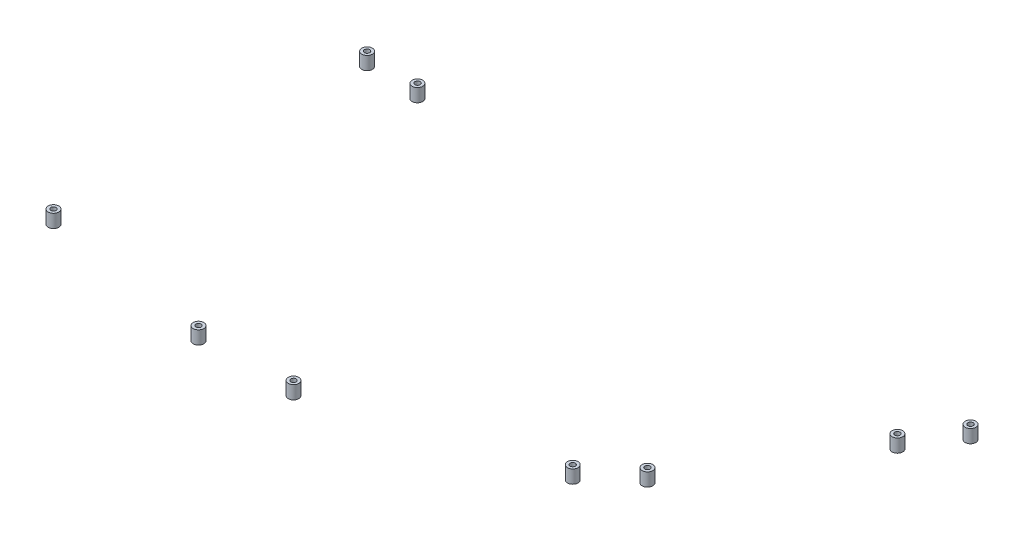
ISO-10303-21;
HEADER;
FILE_DESCRIPTION(('STEP AP214'),'2;1');
FILE_NAME('part.step','',(''),(''),'','','');
FILE_SCHEMA(('AUTOMOTIVE_DESIGN { 1 0 10303 214 1 1 1 1 }'));
ENDSEC;
DATA;
#1=APPLICATION_CONTEXT('core data for automotive mechanical design processes');
#2=APPLICATION_PROTOCOL_DEFINITION('international standard','automotive_design',2000,#1);
#3=PRODUCT_CONTEXT('',#1,'mechanical');
#4=PRODUCT('Part','Part','',(#3));
#5=PRODUCT_RELATED_PRODUCT_CATEGORY('part','',(#4));
#6=PRODUCT_DEFINITION_FORMATION('','',#4);
#7=PRODUCT_DEFINITION_CONTEXT('part definition',#1,'design');
#8=PRODUCT_DEFINITION('design','',#6,#7);
#9=PRODUCT_DEFINITION_SHAPE('','',#8);
#10=(LENGTH_UNIT() NAMED_UNIT(*) SI_UNIT(.MILLI.,.METRE.));
#11=(NAMED_UNIT(*) PLANE_ANGLE_UNIT() SI_UNIT($,.RADIAN.));
#12=(NAMED_UNIT(*) SI_UNIT($,.STERADIAN.) SOLID_ANGLE_UNIT());
#13=UNCERTAINTY_MEASURE_WITH_UNIT(LENGTH_MEASURE(1.E-05),#10,'distance_accuracy_value','');
#14=(GEOMETRIC_REPRESENTATION_CONTEXT(3) GLOBAL_UNCERTAINTY_ASSIGNED_CONTEXT((#13)) GLOBAL_UNIT_ASSIGNED_CONTEXT((#10,
#11,#12)) REPRESENTATION_CONTEXT('',''));
#15=CARTESIAN_POINT('',(0.,0.,0.));
#16=DIRECTION('',(0.,0.,1.));
#17=DIRECTION('',(1.,0.,0.));
#18=AXIS2_PLACEMENT_3D('',#15,#16,#17);
#19=CARTESIAN_POINT('',(-517.500474948423,435.000000002555,-426.079389265339));
#20=DIRECTION('',(7.38219858506528E-12,1.,2.03786987285071E-12));
#21=DIRECTION('',(-1.,7.38219858506528E-12,0.));
#22=AXIS2_PLACEMENT_3D('',#19,#20,#21);
#23=CYLINDRICAL_SURFACE('',#22,3.99999999983019);
#24=CARTESIAN_POINT('',(-517.500474948423,435.000000002563,-430.079389265169));
#25=CARTESIAN_POINT('',(-509.500474948423,435.000000002504,-430.079389265169));
#26=CARTESIAN_POINT('',(-509.500474948423,435.000000002488,-422.079389265508));
#27=CARTESIAN_POINT('',(-517.500474948423,435.000000002547,-422.079389265508));
#28=CARTESIAN_POINT('',(-525.500474948423,435.000000002606,-422.079389265508));
#29=CARTESIAN_POINT('',(-525.500474948423,435.000000002622,-430.079389265169));
#30=CARTESIAN_POINT('',(-517.500474948423,435.000000002563,-430.079389265169));
#31=(BOUNDED_CURVE() B_SPLINE_CURVE(3,(#24,#25,#26,#27,#28,#29,#30),.UNSPECIFIED.,.T.,
.F.) B_SPLINE_CURVE_WITH_KNOTS((4,3,4),(0.,0.5,1.),
.UNSPECIFIED.) CURVE() GEOMETRIC_REPRESENTATION_ITEM() RATIONAL_B_SPLINE_CURVE((1.,
0.333333333333333,0.333333333333333,1.,0.333333333333333,0.333333333333333,1.)) REPRESENTATION_ITEM(''));
#32=CARTESIAN_POINT('',(-517.500474948423,435.000000002563,-430.079389265169));
#33=VERTEX_POINT('',#32);
#34=EDGE_CURVE('E11',#33,#33,#31,.T.);
#35=ORIENTED_EDGE('',*,*,#34,.F.);
#36=EDGE_LOOP('',(#35));
#37=FACE_BOUND('',#36,.T.);
#38=CARTESIAN_POINT('',(-517.500474948349,445.000000002563,-430.079389265148));
#39=CARTESIAN_POINT('',(-509.500474948349,445.000000002504,-430.079389265148));
#40=CARTESIAN_POINT('',(-509.500474948349,445.000000002488,-422.079389265488));
#41=CARTESIAN_POINT('',(-517.500474948349,445.000000002547,-422.079389265488));
#42=CARTESIAN_POINT('',(-525.500474948349,445.000000002606,-422.079389265488));
#43=CARTESIAN_POINT('',(-525.500474948349,445.000000002622,-430.079389265148));
#44=CARTESIAN_POINT('',(-517.500474948349,445.000000002563,-430.079389265148));
#45=(BOUNDED_CURVE() B_SPLINE_CURVE(3,(#38,#39,#40,#41,#42,#43,#44),.UNSPECIFIED.,.T.,
.F.) B_SPLINE_CURVE_WITH_KNOTS((4,3,4),(0.,0.5,1.),
.UNSPECIFIED.) CURVE() GEOMETRIC_REPRESENTATION_ITEM() RATIONAL_B_SPLINE_CURVE((1.,
0.333333333333333,0.333333333333333,1.,0.333333333333333,0.333333333333333,1.)) REPRESENTATION_ITEM(''));
#46=CARTESIAN_POINT('',(-517.500474948349,445.000000002563,-430.079389265148));
#47=VERTEX_POINT('',#46);
#48=EDGE_CURVE('E47',#47,#47,#45,.T.);
#49=ORIENTED_EDGE('',*,*,#48,.T.);
#50=EDGE_LOOP('',(#49));
#51=FACE_BOUND('',#50,.T.);
#52=ADVANCED_FACE('F44',(#37,#51),#23,.T.);
#53=CARTESIAN_POINT('',(-517.500474948423,435.000000002547,-422.079389265508));
#54=DIRECTION('',(-7.37604421985336E-12,-1.,-2.04003480783533E-12));
#55=DIRECTION('',(1.,-7.37604421985336E-12,0.));
#56=AXIS2_PLACEMENT_3D('',#53,#54,#55);
#57=PLANE('',#56);
#58=CARTESIAN_POINT('',(-517.500474948423,435.000000002555,-426.174740181992));
#59=DIRECTION('',(-7.38219858506528E-12,-1.,-2.03786987285071E-12));
#60=DIRECTION('',(-1.,7.38219858506528E-12,0.));
#61=AXIS2_PLACEMENT_3D('',#58,#59,#60);
#62=CIRCLE('',#61,2.);
#63=CARTESIAN_POINT('',(-519.500474948423,435.00000000257,-426.174740181992));
#64=VERTEX_POINT('',#63);
#65=EDGE_CURVE('E56',#64,#64,#62,.T.);
#66=ORIENTED_EDGE('',*,*,#65,.F.);
#67=EDGE_LOOP('',(#66));
#68=FACE_BOUND('',#67,.T.);
#69=ORIENTED_EDGE('',*,*,#34,.T.);
#70=EDGE_LOOP('',(#69));
#71=FACE_BOUND('',#70,.T.);
#72=ADVANCED_FACE('F72',(#68,#71),#57,.T.);
#73=CARTESIAN_POINT('',(-517.500474948349,445.000000002547,-422.079389265488));
#74=DIRECTION('',(-7.37604421985336E-12,-1.,-2.04003480783533E-12));
#75=DIRECTION('',(1.,-7.37604421985336E-12,0.));
#76=AXIS2_PLACEMENT_3D('',#73,#74,#75);
#77=PLANE('',#76);
#78=CARTESIAN_POINT('',(-517.500474948349,445.000000002555,-426.174740181972));
#79=DIRECTION('',(-7.38219858506528E-12,-1.,-2.03786987285071E-12));
#80=DIRECTION('',(-1.,7.38219858506528E-12,0.));
#81=AXIS2_PLACEMENT_3D('',#78,#79,#80);
#82=CIRCLE('',#81,2.);
#83=CARTESIAN_POINT('',(-519.500474948349,445.00000000257,-426.174740181972));
#84=VERTEX_POINT('',#83);
#85=EDGE_CURVE('E60',#84,#84,#82,.T.);
#86=ORIENTED_EDGE('',*,*,#85,.T.);
#87=EDGE_LOOP('',(#86));
#88=FACE_BOUND('',#87,.T.);
#89=ORIENTED_EDGE('',*,*,#48,.F.);
#90=EDGE_LOOP('',(#89));
#91=FACE_BOUND('',#90,.T.);
#92=ADVANCED_FACE('F74',(#88,#91),#77,.F.);
#93=CARTESIAN_POINT('',(-517.500474948423,435.000000002555,-426.174740181992));
#94=DIRECTION('',(7.38219858506528E-12,1.,2.03786987285071E-12));
#95=DIRECTION('',(-1.,7.38219858506528E-12,0.));
#96=AXIS2_PLACEMENT_3D('',#93,#94,#95);
#97=CYLINDRICAL_SURFACE('',#96,2.);
#98=ORIENTED_EDGE('',*,*,#65,.T.);
#99=EDGE_LOOP('',(#98));
#100=FACE_BOUND('',#99,.T.);
#101=ORIENTED_EDGE('',*,*,#85,.F.);
#102=EDGE_LOOP('',(#101));
#103=FACE_BOUND('',#102,.T.);
#104=ADVANCED_FACE('F69',(#100,#103),#97,.F.);
#105=CLOSED_SHELL('',(#52,#72,#92,#104));
#106=MANIFOLD_SOLID_BREP('B2',#105);
#107=CARTESIAN_POINT('',(-557.500474948423,435.000000002854,-428.07638853208));
#108=DIRECTION('',(7.38219858506528E-12,1.,2.03786987285071E-12));
#109=DIRECTION('',(-1.,7.38219858506528E-12,0.));
#110=AXIS2_PLACEMENT_3D('',#107,#108,#109);
#111=CYLINDRICAL_SURFACE('',#110,3.99999999983019);
#112=CARTESIAN_POINT('',(-557.500474948423,435.000000002862,-432.07638853191));
#113=CARTESIAN_POINT('',(-549.500474948423,435.000000002803,-432.07638853191));
#114=CARTESIAN_POINT('',(-549.500474948423,435.000000002787,-424.07638853225));
#115=CARTESIAN_POINT('',(-557.500474948423,435.000000002846,-424.07638853225));
#116=CARTESIAN_POINT('',(-565.500474948423,435.000000002905,-424.07638853225));
#117=CARTESIAN_POINT('',(-565.500474948423,435.000000002921,-432.07638853191));
#118=CARTESIAN_POINT('',(-557.500474948423,435.000000002862,-432.07638853191));
#119=(BOUNDED_CURVE() B_SPLINE_CURVE(3,(#112,#113,#114,#115,#116,#117,#118),.UNSPECIFIED.,.T.,
.F.) B_SPLINE_CURVE_WITH_KNOTS((4,3,4),(0.,0.5,1.),
.UNSPECIFIED.) CURVE() GEOMETRIC_REPRESENTATION_ITEM() RATIONAL_B_SPLINE_CURVE((1.,
0.333333333333333,0.333333333333333,1.,0.333333333333333,0.333333333333333,1.)) REPRESENTATION_ITEM(''));
#120=CARTESIAN_POINT('',(-557.500474948423,435.000000002862,-432.07638853191));
#121=VERTEX_POINT('',#120);
#122=EDGE_CURVE('E43',#121,#121,#119,.T.);
#123=ORIENTED_EDGE('',*,*,#122,.F.);
#124=EDGE_LOOP('',(#123));
#125=FACE_BOUND('',#124,.T.);
#126=CARTESIAN_POINT('',(-557.500474948349,445.000000002862,-432.07638853189));
#127=CARTESIAN_POINT('',(-549.500474948349,445.000000002803,-432.07638853189));
#128=CARTESIAN_POINT('',(-549.500474948349,445.000000002787,-424.076388532229));
#129=CARTESIAN_POINT('',(-557.500474948349,445.000000002846,-424.076388532229));
#130=CARTESIAN_POINT('',(-565.500474948349,445.000000002905,-424.076388532229));
#131=CARTESIAN_POINT('',(-565.500474948349,445.000000002921,-432.07638853189));
#132=CARTESIAN_POINT('',(-557.500474948349,445.000000002862,-432.07638853189));
#133=(BOUNDED_CURVE() B_SPLINE_CURVE(3,(#126,#127,#128,#129,#130,#131,#132),.UNSPECIFIED.,.T.,
.F.) B_SPLINE_CURVE_WITH_KNOTS((4,3,4),(0.,0.5,1.),
.UNSPECIFIED.) CURVE() GEOMETRIC_REPRESENTATION_ITEM() RATIONAL_B_SPLINE_CURVE((1.,
0.333333333333333,0.333333333333333,1.,0.333333333333333,0.333333333333333,1.)) REPRESENTATION_ITEM(''));
#134=CARTESIAN_POINT('',(-557.500474948349,445.000000002862,-432.07638853189));
#135=VERTEX_POINT('',#134);
#136=EDGE_CURVE('E127',#135,#135,#133,.T.);
#137=ORIENTED_EDGE('',*,*,#136,.T.);
#138=EDGE_LOOP('',(#137));
#139=FACE_BOUND('',#138,.T.);
#140=ADVANCED_FACE('F124',(#125,#139),#111,.T.);
#141=CARTESIAN_POINT('',(-557.500474948423,435.000000002846,-424.07638853225));
#142=DIRECTION('',(-7.37604421985338E-12,-1.,-2.04003480783533E-12));
#143=DIRECTION('',(1.,-7.37604421985338E-12,0.));
#144=AXIS2_PLACEMENT_3D('',#141,#142,#143);
#145=PLANE('',#144);
#146=CARTESIAN_POINT('',(-557.500474948423,435.000000002854,-428.045174827121));
#147=DIRECTION('',(-7.38219858506528E-12,-1.,-2.03786987285071E-12));
#148=DIRECTION('',(-1.,7.38219858506528E-12,0.));
#149=AXIS2_PLACEMENT_3D('',#146,#147,#148);
#150=CIRCLE('',#149,2.);
#151=CARTESIAN_POINT('',(-559.500474948423,435.000000002869,-428.045174827121));
#152=VERTEX_POINT('',#151);
#153=EDGE_CURVE('E136',#152,#152,#150,.T.);
#154=ORIENTED_EDGE('',*,*,#153,.F.);
#155=EDGE_LOOP('',(#154));
#156=FACE_BOUND('',#155,.T.);
#157=ORIENTED_EDGE('',*,*,#122,.T.);
#158=EDGE_LOOP('',(#157));
#159=FACE_BOUND('',#158,.T.);
#160=ADVANCED_FACE('F152',(#156,#159),#145,.T.);
#161=CARTESIAN_POINT('',(-557.500474948349,445.000000002846,-424.076388532229));
#162=DIRECTION('',(-7.37604421985338E-12,-1.,-2.04003480783533E-12));
#163=DIRECTION('',(1.,-7.37604421985338E-12,0.));
#164=AXIS2_PLACEMENT_3D('',#161,#162,#163);
#165=PLANE('',#164);
#166=CARTESIAN_POINT('',(-557.500474948349,445.000000002854,-428.0451748271));
#167=DIRECTION('',(-7.38219858506528E-12,-1.,-2.03786987285071E-12));
#168=DIRECTION('',(-1.,7.38219858506528E-12,0.));
#169=AXIS2_PLACEMENT_3D('',#166,#167,#168);
#170=CIRCLE('',#169,2.);
#171=CARTESIAN_POINT('',(-559.500474948349,445.000000002869,-428.0451748271));
#172=VERTEX_POINT('',#171);
#173=EDGE_CURVE('E140',#172,#172,#170,.T.);
#174=ORIENTED_EDGE('',*,*,#173,.T.);
#175=EDGE_LOOP('',(#174));
#176=FACE_BOUND('',#175,.T.);
#177=ORIENTED_EDGE('',*,*,#136,.F.);
#178=EDGE_LOOP('',(#177));
#179=FACE_BOUND('',#178,.T.);
#180=ADVANCED_FACE('F154',(#176,#179),#165,.F.);
#181=CARTESIAN_POINT('',(-557.500474948423,435.000000002854,-428.045174827121));
#182=DIRECTION('',(7.38219858506528E-12,1.,2.03786987285071E-12));
#183=DIRECTION('',(-1.,7.38219858506528E-12,0.));
#184=AXIS2_PLACEMENT_3D('',#181,#182,#183);
#185=CYLINDRICAL_SURFACE('',#184,2.);
#186=ORIENTED_EDGE('',*,*,#153,.T.);
#187=EDGE_LOOP('',(#186));
#188=FACE_BOUND('',#187,.T.);
#189=ORIENTED_EDGE('',*,*,#173,.F.);
#190=EDGE_LOOP('',(#189));
#191=FACE_BOUND('',#190,.T.);
#192=ADVANCED_FACE('F149',(#188,#191),#185,.F.);
#193=CLOSED_SHELL('',(#140,#160,#180,#192));
#194=MANIFOLD_SOLID_BREP('B6',#193);
#195=CARTESIAN_POINT('',(-85.5135337310011,434.999999999337,-411.920534849134));
#196=DIRECTION('',(7.38219858506528E-12,1.,2.03786987285071E-12));
#197=DIRECTION('',(-1.,7.38219858506528E-12,0.));
#198=AXIS2_PLACEMENT_3D('',#195,#196,#197);
#199=CYLINDRICAL_SURFACE('',#198,3.9999999999216);
#200=CARTESIAN_POINT('',(-85.5135337310011,434.999999999337,-411.920534849134));
#201=DIRECTION('',(-7.38219858506528E-12,-1.,-2.03786987285071E-12));
#202=DIRECTION('',(-1.,7.38219858506528E-12,0.));
#203=AXIS2_PLACEMENT_3D('',#200,#201,#202);
#204=CIRCLE('',#203,3.9999999999216);
#205=CARTESIAN_POINT('',(-89.5135337309227,434.999999999366,-411.920534849134));
#206=VERTEX_POINT('',#205);
#207=EDGE_CURVE('E123',#206,#206,#204,.T.);
#208=ORIENTED_EDGE('',*,*,#207,.F.);
#209=EDGE_LOOP('',(#208));
#210=FACE_BOUND('',#209,.T.);
#211=CARTESIAN_POINT('',(-85.5135337309273,444.999999999337,-411.920534849114));
#212=DIRECTION('',(-7.38219858506528E-12,-1.,-2.03786987285071E-12));
#213=DIRECTION('',(-1.,7.38219858506528E-12,0.));
#214=AXIS2_PLACEMENT_3D('',#211,#212,#213);
#215=CIRCLE('',#214,3.9999999999216);
#216=CARTESIAN_POINT('',(-89.5135337308489,444.999999999366,-411.920534849114));
#217=VERTEX_POINT('',#216);
#218=EDGE_CURVE('E207',#217,#217,#215,.T.);
#219=ORIENTED_EDGE('',*,*,#218,.T.);
#220=EDGE_LOOP('',(#219));
#221=FACE_BOUND('',#220,.T.);
#222=ADVANCED_FACE('F204',(#210,#221),#199,.T.);
#223=CARTESIAN_POINT('',(-85.5135337310011,434.999999999337,-411.920534849134));
#224=DIRECTION('',(7.38219858506528E-12,1.,2.03786987285071E-12));
#225=DIRECTION('',(-1.,7.38219858506528E-12,0.));
#226=AXIS2_PLACEMENT_3D('',#223,#224,#225);
#227=PLANE('',#226);
#228=CARTESIAN_POINT('',(-85.5135337310011,434.999999999337,-411.920534849134));
#229=DIRECTION('',(-7.38219858506528E-12,-1.,-2.03786987285071E-12));
#230=DIRECTION('',(-1.,7.38219858506528E-12,0.));
#231=AXIS2_PLACEMENT_3D('',#228,#229,#230);
#232=CIRCLE('',#231,2.);
#233=CARTESIAN_POINT('',(-87.5135337310011,434.999999999352,-411.920534849134));
#234=VERTEX_POINT('',#233);
#235=EDGE_CURVE('E214',#234,#234,#232,.T.);
#236=ORIENTED_EDGE('',*,*,#235,.F.);
#237=EDGE_LOOP('',(#236));
#238=FACE_BOUND('',#237,.T.);
#239=ORIENTED_EDGE('',*,*,#207,.T.);
#240=EDGE_LOOP('',(#239));
#241=FACE_BOUND('',#240,.T.);
#242=ADVANCED_FACE('F225',(#238,#241),#227,.F.);
#243=CARTESIAN_POINT('',(-85.5135337309273,444.999999999337,-411.920534849114));
#244=DIRECTION('',(7.38219858506528E-12,1.,2.03786987285071E-12));
#245=DIRECTION('',(-1.,7.38219858506528E-12,0.));
#246=AXIS2_PLACEMENT_3D('',#243,#244,#245);
#247=PLANE('',#246);
#248=CARTESIAN_POINT('',(-85.5135337309273,444.999999999337,-411.920534849114));
#249=DIRECTION('',(-7.38219858506528E-12,-1.,-2.03786987285071E-12));
#250=DIRECTION('',(-1.,7.38219858506528E-12,0.));
#251=AXIS2_PLACEMENT_3D('',#248,#249,#250);
#252=CIRCLE('',#251,2.);
#253=CARTESIAN_POINT('',(-87.5135337309273,444.999999999352,-411.920534849114));
#254=VERTEX_POINT('',#253);
#255=EDGE_CURVE('E216',#254,#254,#252,.T.);
#256=ORIENTED_EDGE('',*,*,#255,.T.);
#257=EDGE_LOOP('',(#256));
#258=FACE_BOUND('',#257,.T.);
#259=ORIENTED_EDGE('',*,*,#218,.F.);
#260=EDGE_LOOP('',(#259));
#261=FACE_BOUND('',#260,.T.);
#262=ADVANCED_FACE('F227',(#258,#261),#247,.T.);
#263=CARTESIAN_POINT('',(-85.5135337310011,434.999999999337,-411.920534849134));
#264=DIRECTION('',(7.38219858506528E-12,1.,2.03786987285071E-12));
#265=DIRECTION('',(-1.,7.38219858506528E-12,0.));
#266=AXIS2_PLACEMENT_3D('',#263,#264,#265);
#267=CYLINDRICAL_SURFACE('',#266,2.);
#268=ORIENTED_EDGE('',*,*,#235,.T.);
#269=EDGE_LOOP('',(#268));
#270=FACE_BOUND('',#269,.T.);
#271=ORIENTED_EDGE('',*,*,#255,.F.);
#272=EDGE_LOOP('',(#271));
#273=FACE_BOUND('',#272,.T.);
#274=ADVANCED_FACE('F222',(#270,#273),#267,.F.);
#275=CLOSED_SHELL('',(#222,#242,#262,#274));
#276=MANIFOLD_SOLID_BREP('B38',#275);
#277=CARTESIAN_POINT('',(-106.941386536483,434.999999999426,-378.144106320549));
#278=DIRECTION('',(7.38219858506528E-12,1.,2.03786987285071E-12));
#279=DIRECTION('',(-1.,7.38219858506528E-12,0.));
#280=AXIS2_PLACEMENT_3D('',#277,#278,#279);
#281=CYLINDRICAL_SURFACE('',#280,3.99999999992193);
#282=CARTESIAN_POINT('',(-106.941386536483,434.999999999426,-378.144106320549));
#283=DIRECTION('',(-7.38219858506528E-12,-1.,-2.03786987285071E-12));
#284=DIRECTION('',(-1.,7.38219858506528E-12,0.));
#285=AXIS2_PLACEMENT_3D('',#282,#283,#284);
#286=CIRCLE('',#285,3.99999999992193);
#287=CARTESIAN_POINT('',(-110.941386536405,434.999999999456,-378.144106320549));
#288=VERTEX_POINT('',#287);
#289=EDGE_CURVE('E203',#288,#288,#286,.T.);
#290=ORIENTED_EDGE('',*,*,#289,.F.);
#291=EDGE_LOOP('',(#290));
#292=FACE_BOUND('',#291,.T.);
#293=CARTESIAN_POINT('',(-106.941386536409,444.999999999426,-378.144106320529));
#294=DIRECTION('',(-7.38219858506528E-12,-1.,-2.03786987285071E-12));
#295=DIRECTION('',(-1.,7.38219858506528E-12,0.));
#296=AXIS2_PLACEMENT_3D('',#293,#294,#295);
#297=CIRCLE('',#296,3.99999999992193);
#298=CARTESIAN_POINT('',(-110.941386536331,444.999999999456,-378.144106320529));
#299=VERTEX_POINT('',#298);
#300=EDGE_CURVE('E277',#299,#299,#297,.T.);
#301=ORIENTED_EDGE('',*,*,#300,.T.);
#302=EDGE_LOOP('',(#301));
#303=FACE_BOUND('',#302,.T.);
#304=ADVANCED_FACE('F274',(#292,#303),#281,.T.);
#305=CARTESIAN_POINT('',(-106.941386536483,434.999999999426,-378.144106320549));
#306=DIRECTION('',(7.38219858506528E-12,1.,2.03786987285071E-12));
#307=DIRECTION('',(-1.,7.38219858506528E-12,0.));
#308=AXIS2_PLACEMENT_3D('',#305,#306,#307);
#309=PLANE('',#308);
#310=CARTESIAN_POINT('',(-106.941386536483,434.999999999426,-378.144106320549));
#311=DIRECTION('',(-7.38219858506528E-12,-1.,-2.03786987285071E-12));
#312=DIRECTION('',(-1.,7.38219858506528E-12,0.));
#313=AXIS2_PLACEMENT_3D('',#310,#311,#312);
#314=CIRCLE('',#313,2.);
#315=CARTESIAN_POINT('',(-108.941386536483,434.999999999441,-378.144106320549));
#316=VERTEX_POINT('',#315);
#317=EDGE_CURVE('E284',#316,#316,#314,.T.);
#318=ORIENTED_EDGE('',*,*,#317,.F.);
#319=EDGE_LOOP('',(#318));
#320=FACE_BOUND('',#319,.T.);
#321=ORIENTED_EDGE('',*,*,#289,.T.);
#322=EDGE_LOOP('',(#321));
#323=FACE_BOUND('',#322,.T.);
#324=ADVANCED_FACE('F295',(#320,#323),#309,.F.);
#325=CARTESIAN_POINT('',(-106.941386536409,444.999999999426,-378.144106320529));
#326=DIRECTION('',(7.38219858506528E-12,1.,2.03786987285071E-12));
#327=DIRECTION('',(-1.,7.38219858506528E-12,0.));
#328=AXIS2_PLACEMENT_3D('',#325,#326,#327);
#329=PLANE('',#328);
#330=CARTESIAN_POINT('',(-106.941386536409,444.999999999426,-378.144106320529));
#331=DIRECTION('',(-7.38219858506528E-12,-1.,-2.03786987285071E-12));
#332=DIRECTION('',(-1.,7.38219858506528E-12,0.));
#333=AXIS2_PLACEMENT_3D('',#330,#331,#332);
#334=CIRCLE('',#333,2.);
#335=CARTESIAN_POINT('',(-108.941386536409,444.999999999441,-378.144106320529));
#336=VERTEX_POINT('',#335);
#337=EDGE_CURVE('E286',#336,#336,#334,.T.);
#338=ORIENTED_EDGE('',*,*,#337,.T.);
#339=EDGE_LOOP('',(#338));
#340=FACE_BOUND('',#339,.T.);
#341=ORIENTED_EDGE('',*,*,#300,.F.);
#342=EDGE_LOOP('',(#341));
#343=FACE_BOUND('',#342,.T.);
#344=ADVANCED_FACE('F297',(#340,#343),#329,.T.);
#345=CARTESIAN_POINT('',(-106.941386536483,434.999999999426,-378.144106320549));
#346=DIRECTION('',(7.38219858506528E-12,1.,2.03786987285071E-12));
#347=DIRECTION('',(-1.,7.38219858506528E-12,0.));
#348=AXIS2_PLACEMENT_3D('',#345,#346,#347);
#349=CYLINDRICAL_SURFACE('',#348,2.);
#350=ORIENTED_EDGE('',*,*,#317,.T.);
#351=EDGE_LOOP('',(#350));
#352=FACE_BOUND('',#351,.T.);
#353=ORIENTED_EDGE('',*,*,#337,.F.);
#354=EDGE_LOOP('',(#353));
#355=FACE_BOUND('',#354,.T.);
#356=ADVANCED_FACE('F292',(#352,#355),#349,.F.);
#357=CLOSED_SHELL('',(#304,#324,#344,#356));
#358=MANIFOLD_SOLID_BREP('B118',#357);
#359=CARTESIAN_POINT('',(-179.166238959109,434.999999999722,-261.544556892225));
#360=DIRECTION('',(7.38219858506528E-12,1.,2.03786987285071E-12));
#361=DIRECTION('',(-1.,7.38219858506528E-12,0.));
#362=AXIS2_PLACEMENT_3D('',#359,#360,#361);
#363=CYLINDRICAL_SURFACE('',#362,3.99999999925616);
#364=CARTESIAN_POINT('',(-179.166238959109,434.999999999722,-261.544556892225));
#365=DIRECTION('',(-7.38219858506528E-12,-1.,-2.03786987285071E-12));
#366=DIRECTION('',(-1.,7.38219858506528E-12,0.));
#367=AXIS2_PLACEMENT_3D('',#364,#365,#366);
#368=CIRCLE('',#367,3.99999999925616);
#369=CARTESIAN_POINT('',(-183.166238958365,434.999999999751,-261.544556892225));
#370=VERTEX_POINT('',#369);
#371=EDGE_CURVE('E273',#370,#370,#368,.T.);
#372=ORIENTED_EDGE('',*,*,#371,.F.);
#373=EDGE_LOOP('',(#372));
#374=FACE_BOUND('',#373,.T.);
#375=CARTESIAN_POINT('',(-179.166238959035,444.999999999722,-261.544556892205));
#376=DIRECTION('',(-7.38219858506528E-12,-1.,-2.03786987285071E-12));
#377=DIRECTION('',(-1.,7.38219858506528E-12,0.));
#378=AXIS2_PLACEMENT_3D('',#375,#376,#377);
#379=CIRCLE('',#378,3.99999999925616);
#380=CARTESIAN_POINT('',(-183.166238958291,444.999999999751,-261.544556892205));
#381=VERTEX_POINT('',#380);
#382=EDGE_CURVE('E347',#381,#381,#379,.T.);
#383=ORIENTED_EDGE('',*,*,#382,.T.);
#384=EDGE_LOOP('',(#383));
#385=FACE_BOUND('',#384,.T.);
#386=ADVANCED_FACE('F344',(#374,#385),#363,.T.);
#387=CARTESIAN_POINT('',(-179.166238959109,434.999999999722,-261.544556892225));
#388=DIRECTION('',(7.38219858506528E-12,1.,2.03786987285071E-12));
#389=DIRECTION('',(-1.,7.38219858506528E-12,0.));
#390=AXIS2_PLACEMENT_3D('',#387,#388,#389);
#391=PLANE('',#390);
#392=CARTESIAN_POINT('',(-179.166238959109,434.999999999722,-261.544556892225));
#393=DIRECTION('',(-7.38219858506528E-12,-1.,-2.03786987285071E-12));
#394=DIRECTION('',(-1.,7.38219858506528E-12,0.));
#395=AXIS2_PLACEMENT_3D('',#392,#393,#394);
#396=CIRCLE('',#395,2.);
#397=CARTESIAN_POINT('',(-181.166238959109,434.999999999737,-261.544556892225));
#398=VERTEX_POINT('',#397);
#399=EDGE_CURVE('E354',#398,#398,#396,.T.);
#400=ORIENTED_EDGE('',*,*,#399,.F.);
#401=EDGE_LOOP('',(#400));
#402=FACE_BOUND('',#401,.T.);
#403=ORIENTED_EDGE('',*,*,#371,.T.);
#404=EDGE_LOOP('',(#403));
#405=FACE_BOUND('',#404,.T.);
#406=ADVANCED_FACE('F365',(#402,#405),#391,.F.);
#407=CARTESIAN_POINT('',(-179.166238959035,444.999999999722,-261.544556892205));
#408=DIRECTION('',(7.38219858506528E-12,1.,2.03786987285071E-12));
#409=DIRECTION('',(-1.,7.38219858506528E-12,0.));
#410=AXIS2_PLACEMENT_3D('',#407,#408,#409);
#411=PLANE('',#410);
#412=CARTESIAN_POINT('',(-179.166238959035,444.999999999722,-261.544556892205));
#413=DIRECTION('',(-7.38219858506528E-12,-1.,-2.03786987285071E-12));
#414=DIRECTION('',(-1.,7.38219858506528E-12,0.));
#415=AXIS2_PLACEMENT_3D('',#412,#413,#414);
#416=CIRCLE('',#415,2.);
#417=CARTESIAN_POINT('',(-181.166238959035,444.999999999737,-261.544556892205));
#418=VERTEX_POINT('',#417);
#419=EDGE_CURVE('E356',#418,#418,#416,.T.);
#420=ORIENTED_EDGE('',*,*,#419,.T.);
#421=EDGE_LOOP('',(#420));
#422=FACE_BOUND('',#421,.T.);
#423=ORIENTED_EDGE('',*,*,#382,.F.);
#424=EDGE_LOOP('',(#423));
#425=FACE_BOUND('',#424,.T.);
#426=ADVANCED_FACE('F367',(#422,#425),#411,.T.);
#427=CARTESIAN_POINT('',(-179.166238959109,434.999999999722,-261.544556892225));
#428=DIRECTION('',(7.38219858506528E-12,1.,2.03786987285071E-12));
#429=DIRECTION('',(-1.,7.38219858506528E-12,0.));
#430=AXIS2_PLACEMENT_3D('',#427,#428,#429);
#431=CYLINDRICAL_SURFACE('',#430,2.);
#432=ORIENTED_EDGE('',*,*,#399,.T.);
#433=EDGE_LOOP('',(#432));
#434=FACE_BOUND('',#433,.T.);
#435=ORIENTED_EDGE('',*,*,#419,.F.);
#436=EDGE_LOOP('',(#435));
#437=FACE_BOUND('',#436,.T.);
#438=ADVANCED_FACE('F362',(#434,#437),#431,.F.);
#439=CLOSED_SHELL('',(#386,#406,#426,#438));
#440=MANIFOLD_SOLID_BREP('B198',#439);
#441=CARTESIAN_POINT('',(-209.294177746805,434.999999999891,-235.232823684304));
#442=DIRECTION('',(7.38219858506528E-12,1.,2.03786987285071E-12));
#443=DIRECTION('',(-1.,7.38219858506528E-12,0.));
#444=AXIS2_PLACEMENT_3D('',#441,#442,#443);
#445=CYLINDRICAL_SURFACE('',#444,3.99999999925617);
#446=CARTESIAN_POINT('',(-209.294177746805,434.999999999891,-235.232823684304));
#447=DIRECTION('',(-7.38219858506528E-12,-1.,-2.03786987285071E-12));
#448=DIRECTION('',(-1.,7.38219858506528E-12,0.));
#449=AXIS2_PLACEMENT_3D('',#446,#447,#448);
#450=CIRCLE('',#449,3.99999999925617);
#451=CARTESIAN_POINT('',(-213.294177746061,434.99999999992,-235.232823684304));
#452=VERTEX_POINT('',#451);
#453=EDGE_CURVE('E343',#452,#452,#450,.T.);
#454=ORIENTED_EDGE('',*,*,#453,.F.);
#455=EDGE_LOOP('',(#454));
#456=FACE_BOUND('',#455,.T.);
#457=CARTESIAN_POINT('',(-209.294177746731,444.999999999891,-235.232823684283));
#458=DIRECTION('',(-7.38219858506528E-12,-1.,-2.03786987285071E-12));
#459=DIRECTION('',(-1.,7.38219858506528E-12,0.));
#460=AXIS2_PLACEMENT_3D('',#457,#458,#459);
#461=CIRCLE('',#460,3.99999999925617);
#462=CARTESIAN_POINT('',(-213.294177745988,444.99999999992,-235.232823684283));
#463=VERTEX_POINT('',#462);
#464=EDGE_CURVE('E417',#463,#463,#461,.T.);
#465=ORIENTED_EDGE('',*,*,#464,.T.);
#466=EDGE_LOOP('',(#465));
#467=FACE_BOUND('',#466,.T.);
#468=ADVANCED_FACE('F414',(#456,#467),#445,.T.);
#469=CARTESIAN_POINT('',(-209.294177746805,434.999999999891,-235.232823684304));
#470=DIRECTION('',(7.38219858506528E-12,1.,2.03786987285071E-12));
#471=DIRECTION('',(-1.,7.38219858506528E-12,0.));
#472=AXIS2_PLACEMENT_3D('',#469,#470,#471);
#473=PLANE('',#472);
#474=CARTESIAN_POINT('',(-209.294177746805,434.999999999891,-235.232823684304));
#475=DIRECTION('',(-7.38219858506528E-12,-1.,-2.03786987285071E-12));
#476=DIRECTION('',(-1.,7.38219858506528E-12,0.));
#477=AXIS2_PLACEMENT_3D('',#474,#475,#476);
#478=CIRCLE('',#477,2.);
#479=CARTESIAN_POINT('',(-211.294177746805,434.999999999905,-235.232823684304));
#480=VERTEX_POINT('',#479);
#481=EDGE_CURVE('E424',#480,#480,#478,.T.);
#482=ORIENTED_EDGE('',*,*,#481,.F.);
#483=EDGE_LOOP('',(#482));
#484=FACE_BOUND('',#483,.T.);
#485=ORIENTED_EDGE('',*,*,#453,.T.);
#486=EDGE_LOOP('',(#485));
#487=FACE_BOUND('',#486,.T.);
#488=ADVANCED_FACE('F435',(#484,#487),#473,.F.);
#489=CARTESIAN_POINT('',(-209.294177746731,444.999999999891,-235.232823684283));
#490=DIRECTION('',(7.38219858506528E-12,1.,2.03786987285071E-12));
#491=DIRECTION('',(-1.,7.38219858506528E-12,0.));
#492=AXIS2_PLACEMENT_3D('',#489,#490,#491);
#493=PLANE('',#492);
#494=CARTESIAN_POINT('',(-209.294177746731,444.999999999891,-235.232823684283));
#495=DIRECTION('',(-7.38219858506528E-12,-1.,-2.03786987285071E-12));
#496=DIRECTION('',(-1.,7.38219858506528E-12,0.));
#497=AXIS2_PLACEMENT_3D('',#494,#495,#496);
#498=CIRCLE('',#497,2.);
#499=CARTESIAN_POINT('',(-211.294177746731,444.999999999905,-235.232823684283));
#500=VERTEX_POINT('',#499);
#501=EDGE_CURVE('E426',#500,#500,#498,.T.);
#502=ORIENTED_EDGE('',*,*,#501,.T.);
#503=EDGE_LOOP('',(#502));
#504=FACE_BOUND('',#503,.T.);
#505=ORIENTED_EDGE('',*,*,#464,.F.);
#506=EDGE_LOOP('',(#505));
#507=FACE_BOUND('',#506,.T.);
#508=ADVANCED_FACE('F437',(#504,#507),#493,.T.);
#509=CARTESIAN_POINT('',(-209.294177746805,434.999999999891,-235.232823684304));
#510=DIRECTION('',(7.38219858506528E-12,1.,2.03786987285071E-12));
#511=DIRECTION('',(-1.,7.38219858506528E-12,0.));
#512=AXIS2_PLACEMENT_3D('',#509,#510,#511);
#513=CYLINDRICAL_SURFACE('',#512,2.);
#514=ORIENTED_EDGE('',*,*,#481,.T.);
#515=EDGE_LOOP('',(#514));
#516=FACE_BOUND('',#515,.T.);
#517=ORIENTED_EDGE('',*,*,#501,.F.);
#518=EDGE_LOOP('',(#517));
#519=FACE_BOUND('',#518,.T.);
#520=ADVANCED_FACE('F432',(#516,#519),#513,.F.);
#521=CLOSED_SHELL('',(#468,#488,#508,#520));
#522=MANIFOLD_SOLID_BREP('B268',#521);
#523=CARTESIAN_POINT('',(-369.907883248338,435.000000000974,-184.906368668648));
#524=DIRECTION('',(7.38219858506528E-12,1.,2.03786987285071E-12));
#525=DIRECTION('',(-1.,7.38219858506528E-12,0.));
#526=AXIS2_PLACEMENT_3D('',#523,#524,#525);
#527=CYLINDRICAL_SURFACE('',#526,3.99999999999999);
#528=CARTESIAN_POINT('',(-369.907883248338,435.000000000974,-184.906368668648));
#529=DIRECTION('',(-7.38219858506528E-12,-1.,-2.03786987285071E-12));
#530=DIRECTION('',(-1.,7.38219858506528E-12,0.));
#531=AXIS2_PLACEMENT_3D('',#528,#529,#530);
#532=CIRCLE('',#531,3.99999999999999);
#533=CARTESIAN_POINT('',(-373.907883248338,435.000000001003,-184.906368668648));
#534=VERTEX_POINT('',#533);
#535=EDGE_CURVE('E413',#534,#534,#532,.T.);
#536=ORIENTED_EDGE('',*,*,#535,.F.);
#537=EDGE_LOOP('',(#536));
#538=FACE_BOUND('',#537,.T.);
#539=CARTESIAN_POINT('',(-369.907883248264,445.000000000974,-184.906368668627));
#540=DIRECTION('',(-7.38219858506528E-12,-1.,-2.03786987285071E-12));
#541=DIRECTION('',(-1.,7.38219858506528E-12,0.));
#542=AXIS2_PLACEMENT_3D('',#539,#540,#541);
#543=CIRCLE('',#542,3.99999999999999);
#544=CARTESIAN_POINT('',(-373.907883248264,445.000000001003,-184.906368668627));
#545=VERTEX_POINT('',#544);
#546=EDGE_CURVE('E487',#545,#545,#543,.T.);
#547=ORIENTED_EDGE('',*,*,#546,.T.);
#548=EDGE_LOOP('',(#547));
#549=FACE_BOUND('',#548,.T.);
#550=ADVANCED_FACE('F484',(#538,#549),#527,.T.);
#551=CARTESIAN_POINT('',(-369.907883248338,435.000000000974,-184.906368668648));
#552=DIRECTION('',(7.38219858506528E-12,1.,2.03786987285071E-12));
#553=DIRECTION('',(-1.,7.38219858506528E-12,0.));
#554=AXIS2_PLACEMENT_3D('',#551,#552,#553);
#555=PLANE('',#554);
#556=CARTESIAN_POINT('',(-369.907883248338,435.000000000974,-184.906368668648));
#557=DIRECTION('',(-7.38219858506528E-12,-1.,-2.03786987285071E-12));
#558=DIRECTION('',(-1.,7.38219858506528E-12,0.));
#559=AXIS2_PLACEMENT_3D('',#556,#557,#558);
#560=CIRCLE('',#559,2.);
#561=CARTESIAN_POINT('',(-371.907883248338,435.000000000989,-184.906368668648));
#562=VERTEX_POINT('',#561);
#563=EDGE_CURVE('E494',#562,#562,#560,.T.);
#564=ORIENTED_EDGE('',*,*,#563,.F.);
#565=EDGE_LOOP('',(#564));
#566=FACE_BOUND('',#565,.T.);
#567=ORIENTED_EDGE('',*,*,#535,.T.);
#568=EDGE_LOOP('',(#567));
#569=FACE_BOUND('',#568,.T.);
#570=ADVANCED_FACE('F505',(#566,#569),#555,.F.);
#571=CARTESIAN_POINT('',(-369.907883248264,445.000000000974,-184.906368668627));
#572=DIRECTION('',(7.38219858506528E-12,1.,2.03786987285071E-12));
#573=DIRECTION('',(-1.,7.38219858506528E-12,0.));
#574=AXIS2_PLACEMENT_3D('',#571,#572,#573);
#575=PLANE('',#574);
#576=CARTESIAN_POINT('',(-369.907883248264,445.000000000974,-184.906368668627));
#577=DIRECTION('',(-7.38219858506528E-12,-1.,-2.03786987285071E-12));
#578=DIRECTION('',(-1.,7.38219858506528E-12,0.));
#579=AXIS2_PLACEMENT_3D('',#576,#577,#578);
#580=CIRCLE('',#579,2.);
#581=CARTESIAN_POINT('',(-371.907883248264,445.000000000989,-184.906368668627));
#582=VERTEX_POINT('',#581);
#583=EDGE_CURVE('E496',#582,#582,#580,.T.);
#584=ORIENTED_EDGE('',*,*,#583,.T.);
#585=EDGE_LOOP('',(#584));
#586=FACE_BOUND('',#585,.T.);
#587=ORIENTED_EDGE('',*,*,#546,.F.);
#588=EDGE_LOOP('',(#587));
#589=FACE_BOUND('',#588,.T.);
#590=ADVANCED_FACE('F507',(#586,#589),#575,.T.);
#591=CARTESIAN_POINT('',(-369.907883248338,435.000000000974,-184.906368668648));
#592=DIRECTION('',(7.38219858506528E-12,1.,2.03786987285071E-12));
#593=DIRECTION('',(-1.,7.38219858506528E-12,0.));
#594=AXIS2_PLACEMENT_3D('',#591,#592,#593);
#595=CYLINDRICAL_SURFACE('',#594,2.);
#596=ORIENTED_EDGE('',*,*,#563,.T.);
#597=EDGE_LOOP('',(#596));
#598=FACE_BOUND('',#597,.T.);
#599=ORIENTED_EDGE('',*,*,#583,.F.);
#600=EDGE_LOOP('',(#599));
#601=FACE_BOUND('',#600,.T.);
#602=ADVANCED_FACE('F502',(#598,#601),#595,.F.);
#603=CLOSED_SHELL('',(#550,#570,#590,#602));
#604=MANIFOLD_SOLID_BREP('B338',#603);
#605=CARTESIAN_POINT('',(-441.663717109634,435.000000001503,-184.906368668622));
#606=DIRECTION('',(7.38219858506528E-12,1.,2.03786987285071E-12));
#607=DIRECTION('',(-1.,7.38219858506528E-12,0.));
#608=AXIS2_PLACEMENT_3D('',#605,#606,#607);
#609=CYLINDRICAL_SURFACE('',#608,3.99999999999999);
#610=CARTESIAN_POINT('',(-441.663717109634,435.000000001503,-184.906368668622));
#611=DIRECTION('',(-7.38219858506528E-12,-1.,-2.03786987285071E-12));
#612=DIRECTION('',(-1.,7.38219858506528E-12,0.));
#613=AXIS2_PLACEMENT_3D('',#610,#611,#612);
#614=CIRCLE('',#613,3.99999999999999);
#615=CARTESIAN_POINT('',(-445.663717109634,435.000000001533,-184.906368668622));
#616=VERTEX_POINT('',#615);
#617=EDGE_CURVE('E483',#616,#616,#614,.T.);
#618=ORIENTED_EDGE('',*,*,#617,.F.);
#619=EDGE_LOOP('',(#618));
#620=FACE_BOUND('',#619,.T.);
#621=CARTESIAN_POINT('',(-441.66371710956,445.000000001503,-184.906368668602));
#622=DIRECTION('',(-7.38219858506528E-12,-1.,-2.03786987285071E-12));
#623=DIRECTION('',(-1.,7.38219858506528E-12,0.));
#624=AXIS2_PLACEMENT_3D('',#621,#622,#623);
#625=CIRCLE('',#624,3.99999999999999);
#626=CARTESIAN_POINT('',(-445.66371710956,445.000000001533,-184.906368668602));
#627=VERTEX_POINT('',#626);
#628=EDGE_CURVE('E556',#627,#627,#625,.T.);
#629=ORIENTED_EDGE('',*,*,#628,.T.);
#630=EDGE_LOOP('',(#629));
#631=FACE_BOUND('',#630,.T.);
#632=ADVANCED_FACE('F553',(#620,#631),#609,.T.);
#633=CARTESIAN_POINT('',(-441.663717109634,435.000000001503,-184.906368668622));
#634=DIRECTION('',(7.38219858506528E-12,1.,2.03786987285071E-12));
#635=DIRECTION('',(-1.,7.38219858506528E-12,0.));
#636=AXIS2_PLACEMENT_3D('',#633,#634,#635);
#637=PLANE('',#636);
#638=CARTESIAN_POINT('',(-441.663717109634,435.000000001503,-184.906368668622));
#639=DIRECTION('',(-7.38219858506528E-12,-1.,-2.03786987285071E-12));
#640=DIRECTION('',(-1.,7.38219858506528E-12,0.));
#641=AXIS2_PLACEMENT_3D('',#638,#639,#640);
#642=CIRCLE('',#641,2.);
#643=CARTESIAN_POINT('',(-443.663717109634,435.000000001518,-184.906368668622));
#644=VERTEX_POINT('',#643);
#645=EDGE_CURVE('E563',#644,#644,#642,.T.);
#646=ORIENTED_EDGE('',*,*,#645,.F.);
#647=EDGE_LOOP('',(#646));
#648=FACE_BOUND('',#647,.T.);
#649=ORIENTED_EDGE('',*,*,#617,.T.);
#650=EDGE_LOOP('',(#649));
#651=FACE_BOUND('',#650,.T.);
#652=ADVANCED_FACE('F574',(#648,#651),#637,.F.);
#653=CARTESIAN_POINT('',(-441.66371710956,445.000000001503,-184.906368668602));
#654=DIRECTION('',(7.38219858506528E-12,1.,2.03786987285071E-12));
#655=DIRECTION('',(-1.,7.38219858506528E-12,0.));
#656=AXIS2_PLACEMENT_3D('',#653,#654,#655);
#657=PLANE('',#656);
#658=CARTESIAN_POINT('',(-441.66371710956,445.000000001503,-184.906368668602));
#659=DIRECTION('',(-7.38219858506528E-12,-1.,-2.03786987285071E-12));
#660=DIRECTION('',(-1.,7.38219858506528E-12,0.));
#661=AXIS2_PLACEMENT_3D('',#658,#659,#660);
#662=CIRCLE('',#661,2.);
#663=CARTESIAN_POINT('',(-443.66371710956,445.000000001518,-184.906368668602));
#664=VERTEX_POINT('',#663);
#665=EDGE_CURVE('E565',#664,#664,#662,.T.);
#666=ORIENTED_EDGE('',*,*,#665,.T.);
#667=EDGE_LOOP('',(#666));
#668=FACE_BOUND('',#667,.T.);
#669=ORIENTED_EDGE('',*,*,#628,.F.);
#670=EDGE_LOOP('',(#669));
#671=FACE_BOUND('',#670,.T.);
#672=ADVANCED_FACE('F576',(#668,#671),#657,.T.);
#673=CARTESIAN_POINT('',(-441.663717109634,435.000000001503,-184.906368668622));
#674=DIRECTION('',(7.38219858506528E-12,1.,2.03786987285071E-12));
#675=DIRECTION('',(-1.,7.38219858506528E-12,0.));
#676=AXIS2_PLACEMENT_3D('',#673,#674,#675);
#677=CYLINDRICAL_SURFACE('',#676,2.);
#678=ORIENTED_EDGE('',*,*,#645,.T.);
#679=EDGE_LOOP('',(#678));
#680=FACE_BOUND('',#679,.T.);
#681=ORIENTED_EDGE('',*,*,#665,.F.);
#682=EDGE_LOOP('',(#681));
#683=FACE_BOUND('',#682,.T.);
#684=ADVANCED_FACE('F571',(#680,#683),#677,.F.);
#685=CLOSED_SHELL('',(#632,#652,#672,#684));
#686=MANIFOLD_SOLID_BREP('B408',#685);
#687=CARTESIAN_POINT('',(-572.687982615458,435.000000002514,-206.365683114504));
#688=DIRECTION('',(7.38219858506528E-12,1.,2.03786987285071E-12));
#689=DIRECTION('',(-1.,7.38219858506528E-12,0.));
#690=AXIS2_PLACEMENT_3D('',#687,#688,#689);
#691=CYLINDRICAL_SURFACE('',#690,3.99999999999999);
#692=CARTESIAN_POINT('',(-572.687982615458,435.000000002514,-206.365683114504));
#693=DIRECTION('',(-7.38219858506528E-12,-1.,-2.03786987285071E-12));
#694=DIRECTION('',(-1.,7.38219858506528E-12,0.));
#695=AXIS2_PLACEMENT_3D('',#692,#693,#694);
#696=CIRCLE('',#695,3.99999999999999);
#697=CARTESIAN_POINT('',(-576.687982615458,435.000000002544,-206.365683114504));
#698=VERTEX_POINT('',#697);
#699=EDGE_CURVE('E552',#698,#698,#696,.T.);
#700=ORIENTED_EDGE('',*,*,#699,.F.);
#701=EDGE_LOOP('',(#700));
#702=FACE_BOUND('',#701,.T.);
#703=CARTESIAN_POINT('',(-572.687982615384,445.000000002514,-206.365683114483));
#704=DIRECTION('',(-7.38219858506528E-12,-1.,-2.03786987285071E-12));
#705=DIRECTION('',(-1.,7.38219858506528E-12,0.));
#706=AXIS2_PLACEMENT_3D('',#703,#704,#705);
#707=CIRCLE('',#706,3.99999999999999);
#708=CARTESIAN_POINT('',(-576.687982615384,445.000000002544,-206.365683114483));
#709=VERTEX_POINT('',#708);
#710=EDGE_CURVE('E618',#709,#709,#707,.T.);
#711=ORIENTED_EDGE('',*,*,#710,.T.);
#712=EDGE_LOOP('',(#711));
#713=FACE_BOUND('',#712,.T.);
#714=ADVANCED_FACE('F615',(#702,#713),#691,.T.);
#715=CARTESIAN_POINT('',(-572.687982615458,435.000000002514,-206.365683114504));
#716=DIRECTION('',(7.38219858506528E-12,1.,2.03786987285071E-12));
#717=DIRECTION('',(-1.,7.38219858506528E-12,0.));
#718=AXIS2_PLACEMENT_3D('',#715,#716,#717);
#719=PLANE('',#718);
#720=CARTESIAN_POINT('',(-572.687982615458,435.000000002514,-206.365683114504));
#721=DIRECTION('',(-7.38219858506528E-12,-1.,-2.03786987285071E-12));
#722=DIRECTION('',(-1.,7.38219858506528E-12,0.));
#723=AXIS2_PLACEMENT_3D('',#720,#721,#722);
#724=CIRCLE('',#723,2.);
#725=CARTESIAN_POINT('',(-574.687982615458,435.000000002529,-206.365683114504));
#726=VERTEX_POINT('',#725);
#727=EDGE_CURVE('E625',#726,#726,#724,.T.);
#728=ORIENTED_EDGE('',*,*,#727,.F.);
#729=EDGE_LOOP('',(#728));
#730=FACE_BOUND('',#729,.T.);
#731=ORIENTED_EDGE('',*,*,#699,.T.);
#732=EDGE_LOOP('',(#731));
#733=FACE_BOUND('',#732,.T.);
#734=ADVANCED_FACE('F636',(#730,#733),#719,.F.);
#735=CARTESIAN_POINT('',(-572.687982615384,445.000000002514,-206.365683114483));
#736=DIRECTION('',(7.38219858506528E-12,1.,2.03786987285071E-12));
#737=DIRECTION('',(-1.,7.38219858506528E-12,0.));
#738=AXIS2_PLACEMENT_3D('',#735,#736,#737);
#739=PLANE('',#738);
#740=CARTESIAN_POINT('',(-572.687982615384,445.000000002514,-206.365683114483));
#741=DIRECTION('',(-7.38219858506528E-12,-1.,-2.03786987285071E-12));
#742=DIRECTION('',(-1.,7.38219858506528E-12,0.));
#743=AXIS2_PLACEMENT_3D('',#740,#741,#742);
#744=CIRCLE('',#743,2.);
#745=CARTESIAN_POINT('',(-574.687982615384,445.000000002529,-206.365683114483));
#746=VERTEX_POINT('',#745);
#747=EDGE_CURVE('E627',#746,#746,#744,.T.);
#748=ORIENTED_EDGE('',*,*,#747,.T.);
#749=EDGE_LOOP('',(#748));
#750=FACE_BOUND('',#749,.T.);
#751=ORIENTED_EDGE('',*,*,#710,.F.);
#752=EDGE_LOOP('',(#751));
#753=FACE_BOUND('',#752,.T.);
#754=ADVANCED_FACE('F638',(#750,#753),#739,.T.);
#755=CARTESIAN_POINT('',(-572.687982615458,435.000000002514,-206.365683114504));
#756=DIRECTION('',(7.38219858506528E-12,1.,2.03786987285071E-12));
#757=DIRECTION('',(-1.,7.38219858506528E-12,0.));
#758=AXIS2_PLACEMENT_3D('',#755,#756,#757);
#759=CYLINDRICAL_SURFACE('',#758,2.);
#760=ORIENTED_EDGE('',*,*,#727,.T.);
#761=EDGE_LOOP('',(#760));
#762=FACE_BOUND('',#761,.T.);
#763=ORIENTED_EDGE('',*,*,#747,.F.);
#764=EDGE_LOOP('',(#763));
#765=FACE_BOUND('',#764,.T.);
#766=ADVANCED_FACE('F633',(#762,#765),#759,.F.);
#767=CLOSED_SHELL('',(#714,#734,#754,#766));
#768=MANIFOLD_SOLID_BREP('B478',#767);
#769=ADVANCED_BREP_SHAPE_REPRESENTATION('',(#18,#106,#194,#276,#358,#440,#522,#604,#686,#768),#14);
#770=SHAPE_DEFINITION_REPRESENTATION(#9,#769);
ENDSEC;
END-ISO-10303-21;
